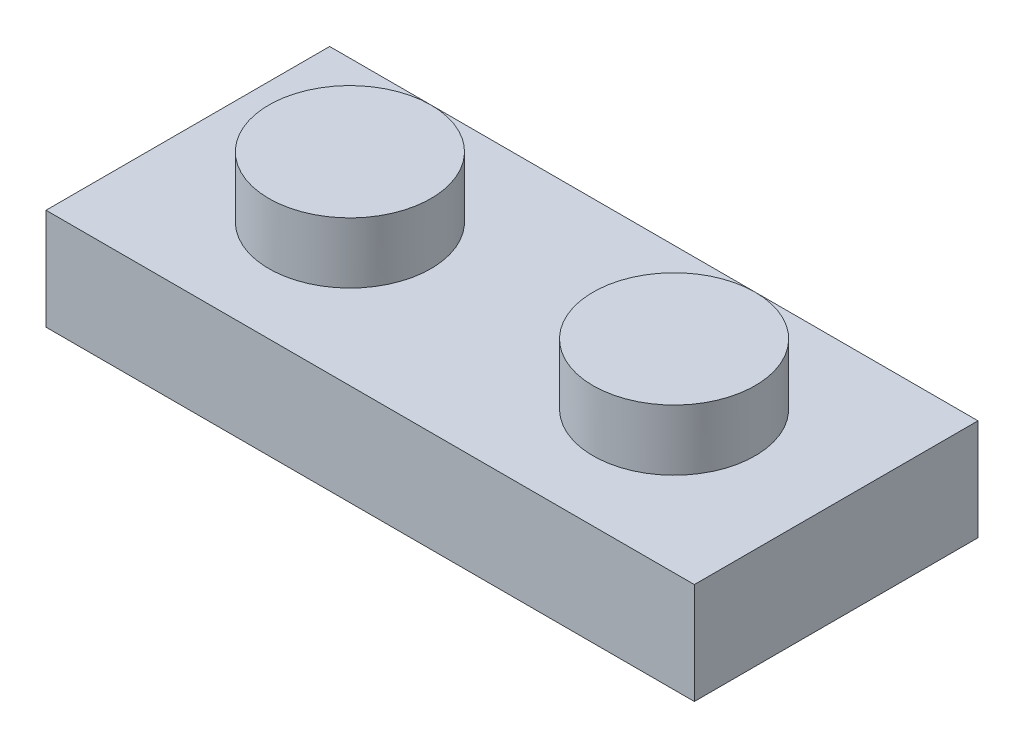
ISO-10303-21;
HEADER;
FILE_DESCRIPTION(('STEP AP214'),'2;1');
FILE_NAME('part.step','',(''),(''),'','','');
FILE_SCHEMA(('AUTOMOTIVE_DESIGN { 1 0 10303 214 1 1 1 1 }'));
ENDSEC;
DATA;
#1=APPLICATION_CONTEXT('core data for automotive mechanical design processes');
#2=APPLICATION_PROTOCOL_DEFINITION('international standard','automotive_design',2000,#1);
#3=PRODUCT_CONTEXT('',#1,'mechanical');
#4=PRODUCT('Part','Part','',(#3));
#5=PRODUCT_RELATED_PRODUCT_CATEGORY('part','',(#4));
#6=PRODUCT_DEFINITION_FORMATION('','',#4);
#7=PRODUCT_DEFINITION_CONTEXT('part definition',#1,'design');
#8=PRODUCT_DEFINITION('design','',#6,#7);
#9=PRODUCT_DEFINITION_SHAPE('','',#8);
#10=(LENGTH_UNIT() NAMED_UNIT(*) SI_UNIT(.MILLI.,.METRE.));
#11=(NAMED_UNIT(*) PLANE_ANGLE_UNIT() SI_UNIT($,.RADIAN.));
#12=(NAMED_UNIT(*) SI_UNIT($,.STERADIAN.) SOLID_ANGLE_UNIT());
#13=UNCERTAINTY_MEASURE_WITH_UNIT(LENGTH_MEASURE(1.E-05),#10,'distance_accuracy_value','');
#14=(GEOMETRIC_REPRESENTATION_CONTEXT(3) GLOBAL_UNCERTAINTY_ASSIGNED_CONTEXT((#13)) GLOBAL_UNIT_ASSIGNED_CONTEXT((#10,
#11,#12)) REPRESENTATION_CONTEXT('',''));
#15=CARTESIAN_POINT('',(0.,0.,0.));
#16=DIRECTION('',(0.,0.,1.));
#17=DIRECTION('',(1.,0.,0.));
#18=AXIS2_PLACEMENT_3D('',#15,#16,#17);
#19=CARTESIAN_POINT('',(-10.16,-3.175,4.445));
#20=DIRECTION('',(1.,0.,0.));
#21=DIRECTION('',(0.,0.,-1.));
#22=AXIS2_PLACEMENT_3D('',#19,#20,#21);
#23=PLANE('',#22);
#24=DIRECTION('',(0.,-1.,0.));
#25=VECTOR('',#24,1.);
#26=CARTESIAN_POINT('',(-10.16,-3.175,-4.445));
#27=LINE('',#26,#25);
#28=CARTESIAN_POINT('',(-10.16,0.,-4.445));
#29=VERTEX_POINT('',#28);
#30=CARTESIAN_POINT('',(-10.16,-3.175,-4.445));
#31=VERTEX_POINT('',#30);
#32=EDGE_CURVE('E189',#29,#31,#27,.T.);
#33=ORIENTED_EDGE('',*,*,#32,.T.);
#34=DIRECTION('',(0.,0.,-1.));
#35=VECTOR('',#34,1.);
#36=CARTESIAN_POINT('',(-10.16,-3.175,4.445));
#37=LINE('',#36,#35);
#38=CARTESIAN_POINT('',(-10.16,-3.175,4.445));
#39=VERTEX_POINT('',#38);
#40=EDGE_CURVE('E221',#39,#31,#37,.T.);
#41=ORIENTED_EDGE('',*,*,#40,.F.);
#42=DIRECTION('',(0.,-1.,0.));
#43=VECTOR('',#42,1.);
#44=CARTESIAN_POINT('',(-10.16,-3.175,4.445));
#45=LINE('',#44,#43);
#46=CARTESIAN_POINT('',(-10.16,0.,4.445));
#47=VERTEX_POINT('',#46);
#48=EDGE_CURVE('E190',#47,#39,#45,.T.);
#49=ORIENTED_EDGE('',*,*,#48,.F.);
#50=DIRECTION('',(0.,0.,-1.));
#51=VECTOR('',#50,1.);
#52=CARTESIAN_POINT('',(-10.16,0.,4.445));
#53=LINE('',#52,#51);
#54=EDGE_CURVE('E200',#47,#29,#53,.T.);
#55=ORIENTED_EDGE('',*,*,#54,.T.);
#56=EDGE_LOOP('',(#33,#41,#49,#55));
#57=FACE_BOUND('',#56,.T.);
#58=ADVANCED_FACE('F51',(#57),#23,.F.);
#59=CARTESIAN_POINT('',(10.16,-3.175,4.445));
#60=DIRECTION('',(0.,1.,0.));
#61=DIRECTION('',(0.,0.,1.));
#62=AXIS2_PLACEMENT_3D('',#59,#60,#61);
#63=PLANE('',#62);
#64=DIRECTION('',(0.,0.,-1.));
#65=VECTOR('',#64,1.);
#66=CARTESIAN_POINT('',(-8.89,-3.175,2.54));
#67=LINE('',#66,#65);
#68=CARTESIAN_POINT('',(-8.89,-3.175,2.54));
#69=VERTEX_POINT('',#68);
#70=CARTESIAN_POINT('',(-8.89,-3.175,-2.54));
#71=VERTEX_POINT('',#70);
#72=EDGE_CURVE('E166',#69,#71,#67,.T.);
#73=ORIENTED_EDGE('',*,*,#72,.F.);
#74=DIRECTION('',(-1.,0.,0.));
#75=VECTOR('',#74,1.);
#76=CARTESIAN_POINT('',(8.89,-3.175,2.54));
#77=LINE('',#76,#75);
#78=CARTESIAN_POINT('',(8.89,-3.175,2.54));
#79=VERTEX_POINT('',#78);
#80=EDGE_CURVE('E66',#79,#69,#77,.T.);
#81=ORIENTED_EDGE('',*,*,#80,.F.);
#82=DIRECTION('',(0.,0.,1.));
#83=VECTOR('',#82,1.);
#84=CARTESIAN_POINT('',(8.89,-3.175,-2.54));
#85=LINE('',#84,#83);
#86=CARTESIAN_POINT('',(8.89,-3.175,-2.54));
#87=VERTEX_POINT('',#86);
#88=EDGE_CURVE('E149',#87,#79,#85,.T.);
#89=ORIENTED_EDGE('',*,*,#88,.F.);
#90=DIRECTION('',(1.,0.,0.));
#91=VECTOR('',#90,1.);
#92=CARTESIAN_POINT('',(-8.89,-3.175,-2.54));
#93=LINE('',#92,#91);
#94=EDGE_CURVE('E154',#71,#87,#93,.T.);
#95=ORIENTED_EDGE('',*,*,#94,.F.);
#96=EDGE_LOOP('',(#73,#81,#89,#95));
#97=FACE_BOUND('',#96,.T.);
#98=DIRECTION('',(1.,0.,0.));
#99=VECTOR('',#98,1.);
#100=CARTESIAN_POINT('',(10.16,-3.175,-4.445));
#101=LINE('',#100,#99);
#102=CARTESIAN_POINT('',(10.16,-3.175,-4.445));
#103=VERTEX_POINT('',#102);
#104=EDGE_CURVE('E204',#31,#103,#101,.T.);
#105=ORIENTED_EDGE('',*,*,#104,.T.);
#106=DIRECTION('',(0.,0.,-1.));
#107=VECTOR('',#106,1.);
#108=CARTESIAN_POINT('',(10.16,-3.175,4.445));
#109=LINE('',#108,#107);
#110=CARTESIAN_POINT('',(10.16,-3.175,4.445));
#111=VERTEX_POINT('',#110);
#112=EDGE_CURVE('E217',#111,#103,#109,.T.);
#113=ORIENTED_EDGE('',*,*,#112,.F.);
#114=DIRECTION('',(1.,0.,0.));
#115=VECTOR('',#114,1.);
#116=CARTESIAN_POINT('',(10.16,-3.175,4.445));
#117=LINE('',#116,#115);
#118=EDGE_CURVE('E104',#39,#111,#117,.T.);
#119=ORIENTED_EDGE('',*,*,#118,.F.);
#120=ORIENTED_EDGE('',*,*,#40,.T.);
#121=EDGE_LOOP('',(#105,#113,#119,#120));
#122=FACE_BOUND('',#121,.T.);
#123=ADVANCED_FACE('F259',(#97,#122),#63,.F.);
#124=CARTESIAN_POINT('',(10.16,0.,4.445));
#125=DIRECTION('',(-1.,0.,0.));
#126=DIRECTION('',(0.,0.,1.));
#127=AXIS2_PLACEMENT_3D('',#124,#125,#126);
#128=PLANE('',#127);
#129=DIRECTION('',(0.,1.,0.));
#130=VECTOR('',#129,1.);
#131=CARTESIAN_POINT('',(10.16,0.,-4.445));
#132=LINE('',#131,#130);
#133=CARTESIAN_POINT('',(10.16,0.,-4.445));
#134=VERTEX_POINT('',#133);
#135=EDGE_CURVE('E207',#103,#134,#132,.T.);
#136=ORIENTED_EDGE('',*,*,#135,.T.);
#137=DIRECTION('',(0.,0.,-1.));
#138=VECTOR('',#137,1.);
#139=CARTESIAN_POINT('',(10.16,0.,4.445));
#140=LINE('',#139,#138);
#141=CARTESIAN_POINT('',(10.16,0.,4.445));
#142=VERTEX_POINT('',#141);
#143=EDGE_CURVE('E214',#142,#134,#140,.T.);
#144=ORIENTED_EDGE('',*,*,#143,.F.);
#145=DIRECTION('',(0.,1.,0.));
#146=VECTOR('',#145,1.);
#147=CARTESIAN_POINT('',(10.16,0.,4.445));
#148=LINE('',#147,#146);
#149=EDGE_CURVE('E195',#111,#142,#148,.T.);
#150=ORIENTED_EDGE('',*,*,#149,.F.);
#151=ORIENTED_EDGE('',*,*,#112,.T.);
#152=EDGE_LOOP('',(#136,#144,#150,#151));
#153=FACE_BOUND('',#152,.T.);
#154=ADVANCED_FACE('F238',(#153),#128,.F.);
#155=CARTESIAN_POINT('',(-10.16,0.,4.445));
#156=DIRECTION('',(0.,-1.,0.));
#157=DIRECTION('',(0.,0.,-1.));
#158=AXIS2_PLACEMENT_3D('',#155,#156,#157);
#159=PLANE('',#158);
#160=CARTESIAN_POINT('',(5.08,0.,0.));
#161=DIRECTION('',(0.,-1.,0.));
#162=DIRECTION('',(0.,0.,-1.));
#163=AXIS2_PLACEMENT_3D('',#160,#161,#162);
#164=CIRCLE('',#163,2.54);
#165=CARTESIAN_POINT('',(5.08,0.,-2.54));
#166=VERTEX_POINT('',#165);
#167=EDGE_CURVE('E59',#166,#166,#164,.F.);
#168=ORIENTED_EDGE('',*,*,#167,.F.);
#169=EDGE_LOOP('',(#168));
#170=FACE_BOUND('',#169,.T.);
#171=CARTESIAN_POINT('',(-5.08,0.,0.));
#172=DIRECTION('',(0.,-1.,0.));
#173=DIRECTION('',(0.,0.,-1.));
#174=AXIS2_PLACEMENT_3D('',#171,#172,#173);
#175=CIRCLE('',#174,2.54);
#176=CARTESIAN_POINT('',(-5.08,0.,-2.54));
#177=VERTEX_POINT('',#176);
#178=EDGE_CURVE('E224',#177,#177,#175,.F.);
#179=ORIENTED_EDGE('',*,*,#178,.F.);
#180=EDGE_LOOP('',(#179));
#181=FACE_BOUND('',#180,.T.);
#182=DIRECTION('',(-1.,0.,0.));
#183=VECTOR('',#182,1.);
#184=CARTESIAN_POINT('',(-10.16,0.,-4.445));
#185=LINE('',#184,#183);
#186=EDGE_CURVE('E96',#134,#29,#185,.T.);
#187=ORIENTED_EDGE('',*,*,#186,.T.);
#188=ORIENTED_EDGE('',*,*,#54,.F.);
#189=DIRECTION('',(-1.,0.,0.));
#190=VECTOR('',#189,1.);
#191=CARTESIAN_POINT('',(-10.16,0.,4.445));
#192=LINE('',#191,#190);
#193=EDGE_CURVE('E75',#142,#47,#192,.T.);
#194=ORIENTED_EDGE('',*,*,#193,.F.);
#195=ORIENTED_EDGE('',*,*,#143,.T.);
#196=EDGE_LOOP('',(#187,#188,#194,#195));
#197=FACE_BOUND('',#196,.T.);
#198=ADVANCED_FACE('F234',(#170,#181,#197),#159,.F.);
#199=CARTESIAN_POINT('',(0.,0.,4.445));
#200=DIRECTION('',(0.,0.,-1.));
#201=DIRECTION('',(-1.,0.,0.));
#202=AXIS2_PLACEMENT_3D('',#199,#200,#201);
#203=PLANE('',#202);
#204=ORIENTED_EDGE('',*,*,#48,.T.);
#205=ORIENTED_EDGE('',*,*,#118,.T.);
#206=ORIENTED_EDGE('',*,*,#149,.T.);
#207=ORIENTED_EDGE('',*,*,#193,.T.);
#208=EDGE_LOOP('',(#204,#205,#206,#207));
#209=FACE_BOUND('',#208,.T.);
#210=ADVANCED_FACE('F237',(#209),#203,.F.);
#211=CARTESIAN_POINT('',(0.,0.,-4.445));
#212=DIRECTION('',(0.,0.,-1.));
#213=DIRECTION('',(-1.,0.,0.));
#214=AXIS2_PLACEMENT_3D('',#211,#212,#213);
#215=PLANE('',#214);
#216=ORIENTED_EDGE('',*,*,#32,.F.);
#217=ORIENTED_EDGE('',*,*,#186,.F.);
#218=ORIENTED_EDGE('',*,*,#135,.F.);
#219=ORIENTED_EDGE('',*,*,#104,.F.);
#220=EDGE_LOOP('',(#216,#217,#218,#219));
#221=FACE_BOUND('',#220,.T.);
#222=ADVANCED_FACE('F245',(#221),#215,.T.);
#223=CARTESIAN_POINT('',(-5.08,1.905,0.));
#224=DIRECTION('',(0.,-1.,0.));
#225=DIRECTION('',(0.,0.,-1.));
#226=AXIS2_PLACEMENT_3D('',#223,#224,#225);
#227=CYLINDRICAL_SURFACE('',#226,2.54);
#228=CARTESIAN_POINT('',(-5.08,1.905,0.));
#229=DIRECTION('',(0.,1.,0.));
#230=DIRECTION('',(0.,0.,1.));
#231=AXIS2_PLACEMENT_3D('',#228,#229,#230);
#232=CIRCLE('',#231,2.54);
#233=CARTESIAN_POINT('',(-5.08,1.905,2.54));
#234=VERTEX_POINT('',#233);
#235=EDGE_CURVE('E185',#234,#234,#232,.T.);
#236=ORIENTED_EDGE('',*,*,#235,.F.);
#237=EDGE_LOOP('',(#236));
#238=FACE_BOUND('',#237,.T.);
#239=ORIENTED_EDGE('',*,*,#178,.T.);
#240=EDGE_LOOP('',(#239));
#241=FACE_BOUND('',#240,.T.);
#242=ADVANCED_FACE('F242',(#238,#241),#227,.T.);
#243=CARTESIAN_POINT('',(-5.08,1.905,0.));
#244=DIRECTION('',(0.,1.,0.));
#245=DIRECTION('',(0.,0.,1.));
#246=AXIS2_PLACEMENT_3D('',#243,#244,#245);
#247=PLANE('',#246);
#248=ORIENTED_EDGE('',*,*,#235,.T.);
#249=EDGE_LOOP('',(#248));
#250=FACE_BOUND('',#249,.T.);
#251=ADVANCED_FACE('F244',(#250),#247,.T.);
#252=CARTESIAN_POINT('',(5.08,1.905,0.));
#253=DIRECTION('',(0.,-1.,0.));
#254=DIRECTION('',(0.,0.,-1.));
#255=AXIS2_PLACEMENT_3D('',#252,#253,#254);
#256=CYLINDRICAL_SURFACE('',#255,2.54);
#257=CARTESIAN_POINT('',(5.08,1.905,0.));
#258=DIRECTION('',(0.,1.,0.));
#259=DIRECTION('',(0.,0.,1.));
#260=AXIS2_PLACEMENT_3D('',#257,#258,#259);
#261=CIRCLE('',#260,2.54);
#262=CARTESIAN_POINT('',(5.08,1.905,2.54));
#263=VERTEX_POINT('',#262);
#264=EDGE_CURVE('E176',#263,#263,#261,.T.);
#265=ORIENTED_EDGE('',*,*,#264,.F.);
#266=EDGE_LOOP('',(#265));
#267=FACE_BOUND('',#266,.T.);
#268=ORIENTED_EDGE('',*,*,#167,.T.);
#269=EDGE_LOOP('',(#268));
#270=FACE_BOUND('',#269,.T.);
#271=ADVANCED_FACE('F232',(#267,#270),#256,.T.);
#272=CARTESIAN_POINT('',(5.08,1.905,0.));
#273=DIRECTION('',(0.,1.,0.));
#274=DIRECTION('',(0.,0.,1.));
#275=AXIS2_PLACEMENT_3D('',#272,#273,#274);
#276=PLANE('',#275);
#277=ORIENTED_EDGE('',*,*,#264,.T.);
#278=EDGE_LOOP('',(#277));
#279=FACE_BOUND('',#278,.T.);
#280=ADVANCED_FACE('F314',(#279),#276,.T.);
#281=CARTESIAN_POINT('',(8.89,-1.27,2.54));
#282=DIRECTION('',(0.,0.,1.));
#283=DIRECTION('',(1.,0.,0.));
#284=AXIS2_PLACEMENT_3D('',#281,#282,#283);
#285=PLANE('',#284);
#286=ORIENTED_EDGE('',*,*,#80,.T.);
#287=DIRECTION('',(0.,-1.,0.));
#288=VECTOR('',#287,1.);
#289=CARTESIAN_POINT('',(-8.89,-1.27,2.54));
#290=LINE('',#289,#288);
#291=CARTESIAN_POINT('',(-8.89,-1.27,2.54));
#292=VERTEX_POINT('',#291);
#293=EDGE_CURVE('E124',#292,#69,#290,.T.);
#294=ORIENTED_EDGE('',*,*,#293,.F.);
#295=DIRECTION('',(-1.,0.,0.));
#296=VECTOR('',#295,1.);
#297=CARTESIAN_POINT('',(8.89,-1.27,2.54));
#298=LINE('',#297,#296);
#299=CARTESIAN_POINT('',(8.89,-1.27,2.54));
#300=VERTEX_POINT('',#299);
#301=EDGE_CURVE('E128',#300,#292,#298,.T.);
#302=ORIENTED_EDGE('',*,*,#301,.F.);
#303=DIRECTION('',(0.,-1.,0.));
#304=VECTOR('',#303,1.);
#305=CARTESIAN_POINT('',(8.89,-1.27,2.54));
#306=LINE('',#305,#304);
#307=EDGE_CURVE('E173',#300,#79,#306,.T.);
#308=ORIENTED_EDGE('',*,*,#307,.T.);
#309=EDGE_LOOP('',(#286,#294,#302,#308));
#310=FACE_BOUND('',#309,.T.);
#311=ADVANCED_FACE('F126',(#310),#285,.F.);
#312=CARTESIAN_POINT('',(8.89,-1.27,-2.54));
#313=DIRECTION('',(1.,0.,0.));
#314=DIRECTION('',(0.,0.,-1.));
#315=AXIS2_PLACEMENT_3D('',#312,#313,#314);
#316=PLANE('',#315);
#317=ORIENTED_EDGE('',*,*,#88,.T.);
#318=ORIENTED_EDGE('',*,*,#307,.F.);
#319=DIRECTION('',(0.,0.,1.));
#320=VECTOR('',#319,1.);
#321=CARTESIAN_POINT('',(8.89,-1.27,-2.54));
#322=LINE('',#321,#320);
#323=CARTESIAN_POINT('',(8.89,-1.27,-2.54));
#324=VERTEX_POINT('',#323);
#325=EDGE_CURVE('E135',#324,#300,#322,.T.);
#326=ORIENTED_EDGE('',*,*,#325,.F.);
#327=DIRECTION('',(0.,-1.,0.));
#328=VECTOR('',#327,1.);
#329=CARTESIAN_POINT('',(8.89,-1.27,-2.54));
#330=LINE('',#329,#328);
#331=EDGE_CURVE('E177',#324,#87,#330,.T.);
#332=ORIENTED_EDGE('',*,*,#331,.T.);
#333=EDGE_LOOP('',(#317,#318,#326,#332));
#334=FACE_BOUND('',#333,.T.);
#335=ADVANCED_FACE('F334',(#334),#316,.F.);
#336=CARTESIAN_POINT('',(-8.89,-1.27,-2.54));
#337=DIRECTION('',(0.,0.,-1.));
#338=DIRECTION('',(-1.,0.,0.));
#339=AXIS2_PLACEMENT_3D('',#336,#337,#338);
#340=PLANE('',#339);
#341=ORIENTED_EDGE('',*,*,#94,.T.);
#342=ORIENTED_EDGE('',*,*,#331,.F.);
#343=DIRECTION('',(1.,0.,0.));
#344=VECTOR('',#343,1.);
#345=CARTESIAN_POINT('',(-8.89,-1.27,-2.54));
#346=LINE('',#345,#344);
#347=CARTESIAN_POINT('',(-8.89,-1.27,-2.54));
#348=VERTEX_POINT('',#347);
#349=EDGE_CURVE('E144',#348,#324,#346,.T.);
#350=ORIENTED_EDGE('',*,*,#349,.F.);
#351=DIRECTION('',(0.,-1.,0.));
#352=VECTOR('',#351,1.);
#353=CARTESIAN_POINT('',(-8.89,-1.27,-2.54));
#354=LINE('',#353,#352);
#355=EDGE_CURVE('E134',#348,#71,#354,.T.);
#356=ORIENTED_EDGE('',*,*,#355,.T.);
#357=EDGE_LOOP('',(#341,#342,#350,#356));
#358=FACE_BOUND('',#357,.T.);
#359=ADVANCED_FACE('F343',(#358),#340,.F.);
#360=CARTESIAN_POINT('',(-8.89,-1.27,2.54));
#361=DIRECTION('',(-1.,0.,0.));
#362=DIRECTION('',(0.,0.,1.));
#363=AXIS2_PLACEMENT_3D('',#360,#361,#362);
#364=PLANE('',#363);
#365=ORIENTED_EDGE('',*,*,#72,.T.);
#366=ORIENTED_EDGE('',*,*,#355,.F.);
#367=DIRECTION('',(0.,0.,-1.));
#368=VECTOR('',#367,1.);
#369=CARTESIAN_POINT('',(-8.89,-1.27,2.54));
#370=LINE('',#369,#368);
#371=EDGE_CURVE('E138',#292,#348,#370,.T.);
#372=ORIENTED_EDGE('',*,*,#371,.F.);
#373=ORIENTED_EDGE('',*,*,#293,.T.);
#374=EDGE_LOOP('',(#365,#366,#372,#373));
#375=FACE_BOUND('',#374,.T.);
#376=ADVANCED_FACE('F139',(#375),#364,.F.);
#377=CARTESIAN_POINT('',(0.,-1.27,0.));
#378=DIRECTION('',(0.,-1.,0.));
#379=DIRECTION('',(0.,0.,-1.));
#380=AXIS2_PLACEMENT_3D('',#377,#378,#379);
#381=PLANE('',#380);
#382=CARTESIAN_POINT('',(0.,-1.27,0.));
#383=DIRECTION('',(0.,-1.,0.));
#384=DIRECTION('',(0.,0.,-1.));
#385=AXIS2_PLACEMENT_3D('',#382,#383,#384);
#386=CIRCLE('',#385,1.905);
#387=CARTESIAN_POINT('',(0.,-1.27,-1.905));
#388=VERTEX_POINT('',#387);
#389=EDGE_CURVE('E518',#388,#388,#386,.T.);
#390=ORIENTED_EDGE('',*,*,#389,.F.);
#391=EDGE_LOOP('',(#390));
#392=FACE_BOUND('',#391,.T.);
#393=CARTESIAN_POINT('',(-5.08,-1.27,0.));
#394=DIRECTION('',(0.,-1.,0.));
#395=DIRECTION('',(0.,0.,-1.));
#396=AXIS2_PLACEMENT_3D('',#393,#394,#395);
#397=CIRCLE('',#396,1.905);
#398=CARTESIAN_POINT('',(-5.08,-1.27,-1.905));
#399=VERTEX_POINT('',#398);
#400=EDGE_CURVE('E530',#399,#399,#397,.T.);
#401=ORIENTED_EDGE('',*,*,#400,.F.);
#402=EDGE_LOOP('',(#401));
#403=FACE_BOUND('',#402,.T.);
#404=CARTESIAN_POINT('',(5.08,-1.27,0.));
#405=DIRECTION('',(0.,-1.,0.));
#406=DIRECTION('',(0.,0.,-1.));
#407=AXIS2_PLACEMENT_3D('',#404,#405,#406);
#408=CIRCLE('',#407,1.905);
#409=CARTESIAN_POINT('',(5.08,-1.27,-1.905));
#410=VERTEX_POINT('',#409);
#411=EDGE_CURVE('E157',#410,#410,#408,.T.);
#412=ORIENTED_EDGE('',*,*,#411,.F.);
#413=EDGE_LOOP('',(#412));
#414=FACE_BOUND('',#413,.T.);
#415=ORIENTED_EDGE('',*,*,#301,.T.);
#416=ORIENTED_EDGE('',*,*,#371,.T.);
#417=ORIENTED_EDGE('',*,*,#349,.T.);
#418=ORIENTED_EDGE('',*,*,#325,.T.);
#419=EDGE_LOOP('',(#415,#416,#417,#418));
#420=FACE_BOUND('',#419,.T.);
#421=ADVANCED_FACE('F146',(#392,#403,#414,#420),#381,.T.);
#422=CARTESIAN_POINT('',(5.08,1.27,0.));
#423=DIRECTION('',(0.,-1.,0.));
#424=DIRECTION('',(0.,0.,-1.));
#425=AXIS2_PLACEMENT_3D('',#422,#423,#424);
#426=CYLINDRICAL_SURFACE('',#425,1.905);
#427=CARTESIAN_POINT('',(5.08,1.27,0.));
#428=DIRECTION('',(0.,-1.,0.));
#429=DIRECTION('',(0.,0.,-1.));
#430=AXIS2_PLACEMENT_3D('',#427,#428,#429);
#431=CIRCLE('',#430,1.905);
#432=CARTESIAN_POINT('',(5.08,1.27,-1.905));
#433=VERTEX_POINT('',#432);
#434=EDGE_CURVE('E533',#433,#433,#431,.T.);
#435=ORIENTED_EDGE('',*,*,#434,.F.);
#436=EDGE_LOOP('',(#435));
#437=FACE_BOUND('',#436,.T.);
#438=ORIENTED_EDGE('',*,*,#411,.T.);
#439=EDGE_LOOP('',(#438));
#440=FACE_BOUND('',#439,.T.);
#441=ADVANCED_FACE('F371',(#437,#440),#426,.F.);
#442=CARTESIAN_POINT('',(5.08,1.27,0.));
#443=DIRECTION('',(0.,-1.,0.));
#444=DIRECTION('',(0.,0.,-1.));
#445=AXIS2_PLACEMENT_3D('',#442,#443,#444);
#446=PLANE('',#445);
#447=ORIENTED_EDGE('',*,*,#434,.T.);
#448=EDGE_LOOP('',(#447));
#449=FACE_BOUND('',#448,.T.);
#450=ADVANCED_FACE('F383',(#449),#446,.T.);
#451=CARTESIAN_POINT('',(-5.08,1.27,0.));
#452=DIRECTION('',(0.,-1.,0.));
#453=DIRECTION('',(0.,0.,-1.));
#454=AXIS2_PLACEMENT_3D('',#451,#452,#453);
#455=CYLINDRICAL_SURFACE('',#454,1.905);
#456=CARTESIAN_POINT('',(-5.08,1.27,0.));
#457=DIRECTION('',(0.,-1.,0.));
#458=DIRECTION('',(0.,0.,-1.));
#459=AXIS2_PLACEMENT_3D('',#456,#457,#458);
#460=CIRCLE('',#459,1.905);
#461=CARTESIAN_POINT('',(-5.08,1.27,-1.905));
#462=VERTEX_POINT('',#461);
#463=EDGE_CURVE('E167',#462,#462,#460,.T.);
#464=ORIENTED_EDGE('',*,*,#463,.F.);
#465=EDGE_LOOP('',(#464));
#466=FACE_BOUND('',#465,.T.);
#467=ORIENTED_EDGE('',*,*,#400,.T.);
#468=EDGE_LOOP('',(#467));
#469=FACE_BOUND('',#468,.T.);
#470=ADVANCED_FACE('F393',(#466,#469),#455,.F.);
#471=CARTESIAN_POINT('',(-5.08,1.27,0.));
#472=DIRECTION('',(0.,-1.,0.));
#473=DIRECTION('',(0.,0.,-1.));
#474=AXIS2_PLACEMENT_3D('',#471,#472,#473);
#475=PLANE('',#474);
#476=ORIENTED_EDGE('',*,*,#463,.T.);
#477=EDGE_LOOP('',(#476));
#478=FACE_BOUND('',#477,.T.);
#479=ADVANCED_FACE('F403',(#478),#475,.T.);
#480=CARTESIAN_POINT('',(0.,-8.56315367264149,0.));
#481=DIRECTION('',(0.,1.,0.));
#482=DIRECTION('',(0.,0.,1.));
#483=AXIS2_PLACEMENT_3D('',#480,#481,#482);
#484=CYLINDRICAL_SURFACE('',#483,1.905);
#485=CARTESIAN_POINT('',(0.,-3.175,0.));
#486=DIRECTION('',(0.,1.,0.));
#487=DIRECTION('',(0.,0.,1.));
#488=AXIS2_PLACEMENT_3D('',#485,#486,#487);
#489=CIRCLE('',#488,1.905);
#490=CARTESIAN_POINT('',(0.,-3.175,1.905));
#491=VERTEX_POINT('',#490);
#492=EDGE_CURVE('E516',#491,#491,#489,.T.);
#493=ORIENTED_EDGE('',*,*,#492,.T.);
#494=EDGE_LOOP('',(#493));
#495=FACE_BOUND('',#494,.T.);
#496=ORIENTED_EDGE('',*,*,#389,.T.);
#497=EDGE_LOOP('',(#496));
#498=FACE_BOUND('',#497,.T.);
#499=ADVANCED_FACE('F412',(#495,#498),#484,.T.);
#500=CARTESIAN_POINT('',(0.,-8.56315367264149,0.));
#501=DIRECTION('',(0.,1.,0.));
#502=DIRECTION('',(0.,0.,1.));
#503=AXIS2_PLACEMENT_3D('',#500,#501,#502);
#504=CYLINDRICAL_SURFACE('',#503,0.9525);
#505=CARTESIAN_POINT('',(0.,-3.175,0.));
#506=DIRECTION('',(0.,1.,0.));
#507=DIRECTION('',(0.,0.,1.));
#508=AXIS2_PLACEMENT_3D('',#505,#506,#507);
#509=CIRCLE('',#508,0.9525);
#510=CARTESIAN_POINT('',(0.,-3.175,0.9525));
#511=VERTEX_POINT('',#510);
#512=EDGE_CURVE('E513',#511,#511,#509,.T.);
#513=ORIENTED_EDGE('',*,*,#512,.F.);
#514=EDGE_LOOP('',(#513));
#515=FACE_BOUND('',#514,.T.);
#516=CARTESIAN_POINT('',(0.,-1.27,0.));
#517=DIRECTION('',(0.,-1.,0.));
#518=DIRECTION('',(0.,0.,-1.));
#519=AXIS2_PLACEMENT_3D('',#516,#517,#518);
#520=CIRCLE('',#519,0.9525);
#521=CARTESIAN_POINT('',(0.,-1.27,-0.9525));
#522=VERTEX_POINT('',#521);
#523=EDGE_CURVE('E13',#522,#522,#520,.F.);
#524=ORIENTED_EDGE('',*,*,#523,.T.);
#525=EDGE_LOOP('',(#524));
#526=FACE_BOUND('',#525,.T.);
#527=ADVANCED_FACE('F421',(#515,#526),#504,.F.);
#528=CARTESIAN_POINT('',(10.16,-3.175,4.445));
#529=DIRECTION('',(0.,1.,0.));
#530=DIRECTION('',(0.,0.,1.));
#531=AXIS2_PLACEMENT_3D('',#528,#529,#530);
#532=PLANE('',#531);
#533=ORIENTED_EDGE('',*,*,#512,.T.);
#534=EDGE_LOOP('',(#533));
#535=FACE_BOUND('',#534,.T.);
#536=ORIENTED_EDGE('',*,*,#492,.F.);
#537=EDGE_LOOP('',(#536));
#538=FACE_BOUND('',#537,.T.);
#539=ADVANCED_FACE('F431',(#535,#538),#532,.F.);
#540=ORIENTED_EDGE('',*,*,#523,.F.);
#541=EDGE_LOOP('',(#540));
#542=FACE_BOUND('',#541,.T.);
#543=ADVANCED_FACE('F374',(#542),#381,.T.);
#544=CLOSED_SHELL('',(#58,#123,#154,#198,#210,#222,#242,#251,#271,#280,#311,#335,#359,#376,#421,
#441,#450,#470,#479,#499,#527,#539,#543));
#545=MANIFOLD_SOLID_BREP('B2',#544);
#546=ADVANCED_BREP_SHAPE_REPRESENTATION('',(#18,#545),#14);
#547=SHAPE_DEFINITION_REPRESENTATION(#9,#546);
ENDSEC;
END-ISO-10303-21;
